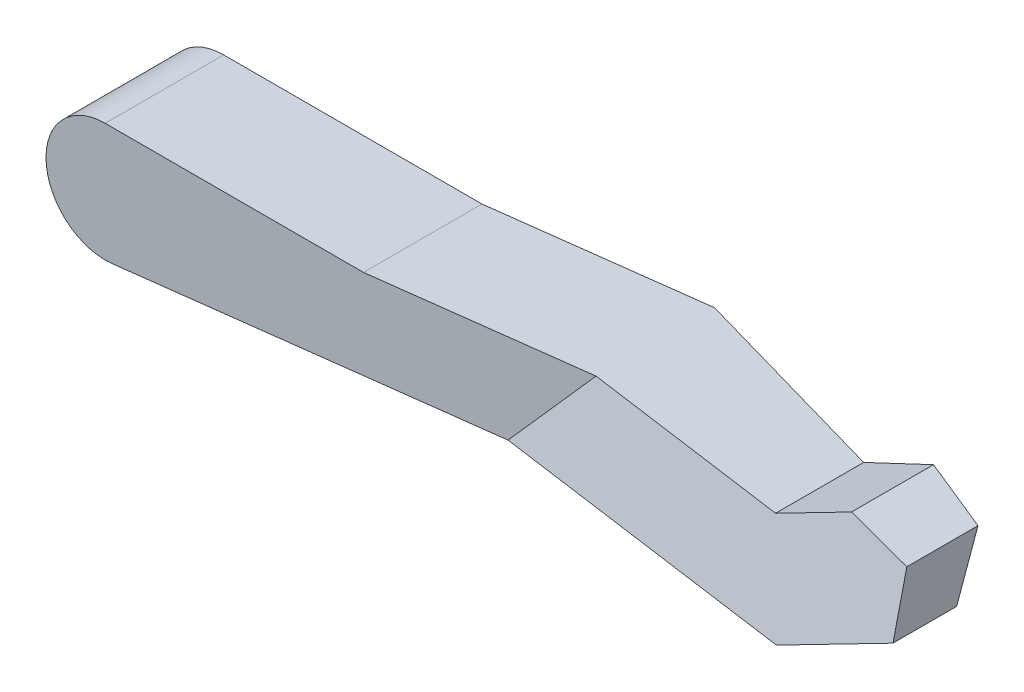
ISO-10303-21;
HEADER;
FILE_DESCRIPTION(('STEP AP214'),'2;1');
FILE_NAME('part.step','',(''),(''),'','','');
FILE_SCHEMA(('AUTOMOTIVE_DESIGN { 1 0 10303 214 1 1 1 1 }'));
ENDSEC;
DATA;
#1=APPLICATION_CONTEXT('core data for automotive mechanical design processes');
#2=APPLICATION_PROTOCOL_DEFINITION('international standard','automotive_design',2000,#1);
#3=PRODUCT_CONTEXT('',#1,'mechanical');
#4=PRODUCT('Part','Part','',(#3));
#5=PRODUCT_RELATED_PRODUCT_CATEGORY('part','',(#4));
#6=PRODUCT_DEFINITION_FORMATION('','',#4);
#7=PRODUCT_DEFINITION_CONTEXT('part definition',#1,'design');
#8=PRODUCT_DEFINITION('design','',#6,#7);
#9=PRODUCT_DEFINITION_SHAPE('','',#8);
#10=(LENGTH_UNIT() NAMED_UNIT(*) SI_UNIT(.MILLI.,.METRE.));
#11=(NAMED_UNIT(*) PLANE_ANGLE_UNIT() SI_UNIT($,.RADIAN.));
#12=(NAMED_UNIT(*) SI_UNIT($,.STERADIAN.) SOLID_ANGLE_UNIT());
#13=UNCERTAINTY_MEASURE_WITH_UNIT(LENGTH_MEASURE(1.E-05),#10,'distance_accuracy_value','');
#14=(GEOMETRIC_REPRESENTATION_CONTEXT(3) GLOBAL_UNCERTAINTY_ASSIGNED_CONTEXT((#13)) GLOBAL_UNIT_ASSIGNED_CONTEXT((#10,
#11,#12)) REPRESENTATION_CONTEXT('',''));
#15=CARTESIAN_POINT('',(0.,0.,0.));
#16=DIRECTION('',(0.,0.,1.));
#17=DIRECTION('',(1.,0.,0.));
#18=AXIS2_PLACEMENT_3D('',#15,#16,#17);
#19=CARTESIAN_POINT('',(0.,0.,11.));
#20=DIRECTION('',(0.,0.,1.));
#21=DIRECTION('',(-1.,0.,0.));
#22=AXIS2_PLACEMENT_3D('',#19,#20,#21);
#23=PLANE('',#22);
#24=DIRECTION('',(-0.993571855676588,-0.1132032137679,0.));
#25=VECTOR('',#24,1.);
#26=CARTESIAN_POINT('',(49.0397786357323,7.60031647523773,11.));
#27=LINE('',#26,#25);
#28=CARTESIAN_POINT('',(33.1426806960217,5.78907095124608,11.));
#29=VERTEX_POINT('',#28);
#30=CARTESIAN_POINT('',(17.4402064834858,4.,11.));
#31=VERTEX_POINT('',#30);
#32=EDGE_CURVE('E169',#29,#31,#27,.T.);
#33=ORIENTED_EDGE('',*,*,#32,.T.);
#34=DIRECTION('',(-1.,0.,0.));
#35=VECTOR('',#34,1.);
#36=CARTESIAN_POINT('',(17.4402064834858,4.,11.));
#37=LINE('',#36,#35);
#38=CARTESIAN_POINT('',(0.,4.,11.));
#39=VERTEX_POINT('',#38);
#40=EDGE_CURVE('E172',#31,#39,#37,.T.);
#41=ORIENTED_EDGE('',*,*,#40,.T.);
#42=CARTESIAN_POINT('',(0.,0.,11.));
#43=DIRECTION('',(0.,0.,1.));
#44=DIRECTION('',(-1.,0.,0.));
#45=AXIS2_PLACEMENT_3D('',#42,#43,#44);
#46=CIRCLE('',#45,4.);
#47=CARTESIAN_POINT('',(0.452812855071593,-3.97428742270635,11.));
#48=VERTEX_POINT('',#47);
#49=EDGE_CURVE('E162',#39,#48,#46,.T.);
#50=ORIENTED_EDGE('',*,*,#49,.T.);
#51=DIRECTION('',(0.993571855676588,0.1132032137679,0.));
#52=VECTOR('',#51,1.);
#53=CARTESIAN_POINT('',(0.452812855071593,-3.97428742270635,11.));
#54=LINE('',#53,#52);
#55=CARTESIAN_POINT('',(27.2010599548502,-0.926709618390534,11.));
#56=VERTEX_POINT('',#55);
#57=EDGE_CURVE('E165',#48,#56,#54,.T.);
#58=ORIENTED_EDGE('',*,*,#57,.T.);
#59=DIRECTION('',(-0.662620048215741,-0.748955720788999,0.));
#60=VECTOR('',#59,1.);
#61=CARTESIAN_POINT('',(15.7179186684471,-13.9060397522108,11.));
#62=LINE('',#61,#60);
#63=EDGE_CURVE('E160',#29,#56,#62,.T.);
#64=ORIENTED_EDGE('',*,*,#63,.F.);
#65=EDGE_LOOP('',(#33,#41,#50,#58,#64));
#66=FACE_BOUND('',#65,.T.);
#67=ADVANCED_FACE('F39',(#66),#23,.T.);
#68=CARTESIAN_POINT('',(0.,0.,11.));
#69=DIRECTION('',(0.,0.,-1.));
#70=DIRECTION('',(1.,0.,0.));
#71=AXIS2_PLACEMENT_3D('',#68,#69,#70);
#72=CYLINDRICAL_SURFACE('',#71,4.);
#73=CARTESIAN_POINT('',(0.,0.,3.));
#74=DIRECTION('',(0.,0.,1.));
#75=DIRECTION('',(-1.,0.,0.));
#76=AXIS2_PLACEMENT_3D('',#73,#74,#75);
#77=CIRCLE('',#76,4.);
#78=CARTESIAN_POINT('',(0.,4.,3.));
#79=VERTEX_POINT('',#78);
#80=CARTESIAN_POINT('',(0.452812855071593,-3.97428742270635,3.));
#81=VERTEX_POINT('',#80);
#82=EDGE_CURVE('E127',#79,#81,#77,.T.);
#83=ORIENTED_EDGE('',*,*,#82,.T.);
#84=DIRECTION('',(0.,0.,-1.));
#85=VECTOR('',#84,1.);
#86=CARTESIAN_POINT('',(0.452812855071593,-3.97428742270635,11.));
#87=LINE('',#86,#85);
#88=EDGE_CURVE('E125',#48,#81,#87,.T.);
#89=ORIENTED_EDGE('',*,*,#88,.F.);
#90=ORIENTED_EDGE('',*,*,#49,.F.);
#91=DIRECTION('',(0.,0.,-1.));
#92=VECTOR('',#91,1.);
#93=CARTESIAN_POINT('',(0.,4.,11.));
#94=LINE('',#93,#92);
#95=EDGE_CURVE('E47',#39,#79,#94,.T.);
#96=ORIENTED_EDGE('',*,*,#95,.T.);
#97=EDGE_LOOP('',(#83,#89,#90,#96));
#98=FACE_BOUND('',#97,.T.);
#99=ADVANCED_FACE('F41',(#98),#72,.T.);
#100=CARTESIAN_POINT('',(17.4402064834858,4.,11.));
#101=DIRECTION('',(0.,1.,0.));
#102=DIRECTION('',(-1.,0.,0.));
#103=AXIS2_PLACEMENT_3D('',#100,#101,#102);
#104=PLANE('',#103);
#105=DIRECTION('',(-1.,0.,0.));
#106=VECTOR('',#105,1.);
#107=CARTESIAN_POINT('',(17.4402064834858,4.,3.));
#108=LINE('',#107,#106);
#109=CARTESIAN_POINT('',(17.4402064834858,4.,3.));
#110=VERTEX_POINT('',#109);
#111=EDGE_CURVE('E166',#110,#79,#108,.T.);
#112=ORIENTED_EDGE('',*,*,#111,.T.);
#113=ORIENTED_EDGE('',*,*,#95,.F.);
#114=ORIENTED_EDGE('',*,*,#40,.F.);
#115=DIRECTION('',(0.,0.,-1.));
#116=VECTOR('',#115,1.);
#117=CARTESIAN_POINT('',(17.4402064834858,4.,11.));
#118=LINE('',#117,#116);
#119=EDGE_CURVE('E180',#31,#110,#118,.T.);
#120=ORIENTED_EDGE('',*,*,#119,.T.);
#121=EDGE_LOOP('',(#112,#113,#114,#120));
#122=FACE_BOUND('',#121,.T.);
#123=ADVANCED_FACE('F209',(#122),#104,.T.);
#124=CARTESIAN_POINT('',(49.0397786357323,7.60031647523773,11.));
#125=DIRECTION('',(-0.1132032137679,0.993571855676588,0.));
#126=DIRECTION('',(-0.993571855676588,-0.1132032137679,0.));
#127=AXIS2_PLACEMENT_3D('',#124,#125,#126);
#128=PLANE('',#127);
#129=DIRECTION('',(-0.933652140999854,-0.106376224626946,-0.342020143325663));
#130=VECTOR('',#129,1.);
#131=CARTESIAN_POINT('',(49.7347941477424,7.67950349037768,9.07810636492084));
#132=LINE('',#131,#130);
#133=CARTESIAN_POINT('',(49.0397786357323,7.60031647523773,8.82350479053072));
#134=VERTEX_POINT('',#133);
#135=CARTESIAN_POINT('',(33.1426806960217,5.78907095124608,3.));
#136=VERTEX_POINT('',#135);
#137=EDGE_CURVE('E158',#134,#136,#132,.T.);
#138=ORIENTED_EDGE('',*,*,#137,.T.);
#139=DIRECTION('',(-0.993571855676588,-0.1132032137679,0.));
#140=VECTOR('',#139,1.);
#141=CARTESIAN_POINT('',(49.0397786357323,7.60031647523773,3.));
#142=LINE('',#141,#140);
#143=EDGE_CURVE('E120',#136,#110,#142,.T.);
#144=ORIENTED_EDGE('',*,*,#143,.T.);
#145=ORIENTED_EDGE('',*,*,#119,.F.);
#146=ORIENTED_EDGE('',*,*,#32,.F.);
#147=DIRECTION('',(0.967067511266677,0.110183425164921,0.229434176772775));
#148=VECTOR('',#147,1.);
#149=CARTESIAN_POINT('',(48.202954740911,7.50497243573992,14.5730096784409));
#150=LINE('',#149,#148);
#151=CARTESIAN_POINT('',(49.0397786357323,7.60031647523773,14.7715439060675));
#152=VERTEX_POINT('',#151);
#153=EDGE_CURVE('E148',#29,#152,#150,.T.);
#154=ORIENTED_EDGE('',*,*,#153,.T.);
#155=DIRECTION('',(0.,0.,-1.));
#156=VECTOR('',#155,1.);
#157=CARTESIAN_POINT('',(49.0397786357323,7.60031647523773,11.));
#158=LINE('',#157,#156);
#159=EDGE_CURVE('E183',#152,#134,#158,.T.);
#160=ORIENTED_EDGE('',*,*,#159,.T.);
#161=EDGE_LOOP('',(#138,#144,#145,#146,#154,#160));
#162=FACE_BOUND('',#161,.T.);
#163=ADVANCED_FACE('F211',(#162),#128,.T.);
#164=CARTESIAN_POINT('',(54.9282032302755,11.,11.));
#165=DIRECTION('',(-0.499999999999995,0.866025403784441,0.));
#166=DIRECTION('',(-0.866025403784441,-0.499999999999995,0.));
#167=AXIS2_PLACEMENT_3D('',#164,#165,#166);
#168=PLANE('',#167);
#169=DIRECTION('',(-0.853407406135946,-0.492714995661003,-0.17008154574525));
#170=VECTOR('',#169,1.);
#171=CARTESIAN_POINT('',(55.0737802389022,11.0840489251185,10.0260632782092));
#172=LINE('',#171,#170);
#173=CARTESIAN_POINT('',(54.9282032302755,11.,9.99705021542795));
#174=VERTEX_POINT('',#173);
#175=EDGE_CURVE('E156',#174,#134,#172,.T.);
#176=ORIENTED_EDGE('',*,*,#175,.T.);
#177=ORIENTED_EDGE('',*,*,#159,.F.);
#178=DIRECTION('',(0.860665139374154,0.496905249899788,0.111088660483856));
#179=VECTOR('',#178,1.);
#180=CARTESIAN_POINT('',(54.4949381736029,10.7498543028996,15.4756578965893));
#181=LINE('',#180,#179);
#182=CARTESIAN_POINT('',(54.9282032302755,11.,15.5315807318226));
#183=VERTEX_POINT('',#182);
#184=EDGE_CURVE('E145',#152,#183,#181,.T.);
#185=ORIENTED_EDGE('',*,*,#184,.T.);
#186=DIRECTION('',(0.,0.,-1.));
#187=VECTOR('',#186,1.);
#188=CARTESIAN_POINT('',(54.9282032302755,11.,11.));
#189=LINE('',#188,#187);
#190=EDGE_CURVE('E186',#183,#174,#189,.T.);
#191=ORIENTED_EDGE('',*,*,#190,.T.);
#192=EDGE_LOOP('',(#176,#177,#185,#191));
#193=FACE_BOUND('',#192,.T.);
#194=ADVANCED_FACE('F216',(#193),#168,.T.);
#195=CARTESIAN_POINT('',(60.,11.,11.));
#196=DIRECTION('',(0.,1.,0.));
#197=DIRECTION('',(-1.,0.,0.));
#198=AXIS2_PLACEMENT_3D('',#195,#196,#197);
#199=PLANE('',#198);
#200=DIRECTION('',(-0.926097764547837,0.,-0.377283620767586));
#201=VECTOR('',#200,1.);
#202=CARTESIAN_POINT('',(59.6284977618995,11.,11.9119065161891));
#203=LINE('',#202,#201);
#204=CARTESIAN_POINT('',(60.,11.,12.0632530747052));
#205=VERTEX_POINT('',#204);
#206=EDGE_CURVE('E154',#205,#174,#203,.T.);
#207=ORIENTED_EDGE('',*,*,#206,.T.);
#208=ORIENTED_EDGE('',*,*,#190,.F.);
#209=DIRECTION('',(0.966911264947976,0.,0.255112927380611));
#210=VECTOR('',#209,1.);
#211=CARTESIAN_POINT('',(58.5521021471396,11.,16.4877216877999));
#212=LINE('',#211,#210);
#213=CARTESIAN_POINT('',(60.,11.,16.8697396383419));
#214=VERTEX_POINT('',#213);
#215=EDGE_CURVE('E142',#183,#214,#212,.T.);
#216=ORIENTED_EDGE('',*,*,#215,.T.);
#217=DIRECTION('',(0.,0.,-1.));
#218=VECTOR('',#217,1.);
#219=CARTESIAN_POINT('',(60.,11.,11.));
#220=LINE('',#219,#218);
#221=EDGE_CURVE('E189',#214,#205,#220,.T.);
#222=ORIENTED_EDGE('',*,*,#221,.T.);
#223=EDGE_LOOP('',(#207,#208,#216,#222));
#224=FACE_BOUND('',#223,.T.);
#225=ADVANCED_FACE('F219',(#224),#199,.T.);
#226=CARTESIAN_POINT('',(60.,7.00000000000001,11.));
#227=DIRECTION('',(1.,0.,0.));
#228=DIRECTION('',(0.,0.,1.));
#229=AXIS2_PLACEMENT_3D('',#226,#227,#228);
#230=PLANE('',#229);
#231=DIRECTION('',(0.,0.940758767954674,-0.339076599777106));
#232=VECTOR('',#231,1.);
#233=CARTESIAN_POINT('',(60.,7.79905809934093,13.2169648791875));
#234=LINE('',#233,#232);
#235=CARTESIAN_POINT('',(60.,7.00000000000001,13.5049684700953));
#236=VERTEX_POINT('',#235);
#237=EDGE_CURVE('E152',#236,#205,#234,.T.);
#238=ORIENTED_EDGE('',*,*,#237,.T.);
#239=ORIENTED_EDGE('',*,*,#221,.F.);
#240=DIRECTION('',(0.,-0.973820652158255,0.227317701532615));
#241=VECTOR('',#240,1.);
#242=CARTESIAN_POINT('',(60.,8.50605808104209,17.4518972907976));
#243=LINE('',#242,#241);
#244=CARTESIAN_POINT('',(60.,7.00000000000001,17.8034544903685));
#245=VERTEX_POINT('',#244);
#246=EDGE_CURVE('E139',#214,#245,#243,.T.);
#247=ORIENTED_EDGE('',*,*,#246,.T.);
#248=DIRECTION('',(0.,0.,-1.));
#249=VECTOR('',#248,1.);
#250=CARTESIAN_POINT('',(60.,7.00000000000001,11.));
#251=LINE('',#250,#249);
#252=EDGE_CURVE('E192',#245,#236,#251,.T.);
#253=ORIENTED_EDGE('',*,*,#252,.T.);
#254=EDGE_LOOP('',(#238,#239,#247,#253));
#255=FACE_BOUND('',#254,.T.);
#256=ADVANCED_FACE('F221',(#255),#230,.T.);
#257=CARTESIAN_POINT('',(50.9589773774762,1.78016315513645,11.));
#258=DIRECTION('',(0.499999999999994,-0.866025403784442,0.));
#259=DIRECTION('',(0.866025403784442,0.499999999999994,0.));
#260=AXIS2_PLACEMENT_3D('',#257,#258,#259);
#261=PLANE('',#260);
#262=DIRECTION('',(0.853407406135947,0.492714995661002,0.170081545745251));
#263=VECTOR('',#262,1.);
#264=CARTESIAN_POINT('',(50.856920364053,1.72124051096392,11.6827800215618));
#265=LINE('',#264,#263);
#266=CARTESIAN_POINT('',(50.9589773774762,1.78016315513645,11.7031196793529));
#267=VERTEX_POINT('',#266);
#268=EDGE_CURVE('E132',#267,#236,#265,.T.);
#269=ORIENTED_EDGE('',*,*,#268,.T.);
#270=ORIENTED_EDGE('',*,*,#252,.F.);
#271=DIRECTION('',(-0.860665139374154,-0.496905249899787,-0.111088660483856));
#272=VECTOR('',#271,1.);
#273=CARTESIAN_POINT('',(50.4200706203417,1.46902519383677,16.5669439433164));
#274=LINE('',#273,#272);
#275=CARTESIAN_POINT('',(50.9589773774761,1.78016315513645,16.6365022733068));
#276=VERTEX_POINT('',#275);
#277=EDGE_CURVE('E134',#245,#276,#274,.T.);
#278=ORIENTED_EDGE('',*,*,#277,.T.);
#279=DIRECTION('',(0.,0.,-1.));
#280=VECTOR('',#279,1.);
#281=CARTESIAN_POINT('',(50.9589773774762,1.78016315513645,11.));
#282=LINE('',#281,#280);
#283=EDGE_CURVE('E195',#276,#267,#282,.T.);
#284=ORIENTED_EDGE('',*,*,#283,.T.);
#285=EDGE_LOOP('',(#269,#270,#278,#284));
#286=FACE_BOUND('',#285,.T.);
#287=ADVANCED_FACE('F197',(#286),#261,.T.);
#288=CARTESIAN_POINT('',(0.452812855071593,-3.97428742270635,11.));
#289=DIRECTION('',(0.1132032137679,-0.993571855676588,0.));
#290=DIRECTION('',(0.993571855676588,0.1132032137679,0.));
#291=AXIS2_PLACEMENT_3D('',#288,#289,#290);
#292=PLANE('',#291);
#293=DIRECTION('',(0.933652140999854,0.106376224626946,0.342020143325663));
#294=VECTOR('',#293,1.);
#295=CARTESIAN_POINT('',(27.2010599548502,-0.926709618390531,3.));
#296=LINE('',#295,#294);
#297=CARTESIAN_POINT('',(27.2010599548502,-0.926709618390531,3.));
#298=VERTEX_POINT('',#297);
#299=EDGE_CURVE('E123',#298,#267,#296,.T.);
#300=ORIENTED_EDGE('',*,*,#299,.T.);
#301=ORIENTED_EDGE('',*,*,#283,.F.);
#302=DIRECTION('',(-0.967067511266677,-0.110183425164921,-0.229434176772776));
#303=VECTOR('',#302,1.);
#304=CARTESIAN_POINT('',(60.9211455975199,2.9152088512904,19.));
#305=LINE('',#304,#303);
#306=EDGE_CURVE('E60',#276,#56,#305,.T.);
#307=ORIENTED_EDGE('',*,*,#306,.T.);
#308=ORIENTED_EDGE('',*,*,#57,.F.);
#309=ORIENTED_EDGE('',*,*,#88,.T.);
#310=DIRECTION('',(0.993571855676588,0.1132032137679,0.));
#311=VECTOR('',#310,1.);
#312=CARTESIAN_POINT('',(0.452812855071593,-3.97428742270635,3.));
#313=LINE('',#312,#311);
#314=EDGE_CURVE('E117',#81,#298,#313,.T.);
#315=ORIENTED_EDGE('',*,*,#314,.T.);
#316=EDGE_LOOP('',(#300,#301,#307,#308,#309,#315));
#317=FACE_BOUND('',#316,.T.);
#318=ADVANCED_FACE('F122',(#317),#292,.T.);
#319=CARTESIAN_POINT('',(0.,0.,3.));
#320=DIRECTION('',(0.,0.,1.));
#321=DIRECTION('',(-1.,0.,0.));
#322=AXIS2_PLACEMENT_3D('',#319,#320,#321);
#323=PLANE('',#322);
#324=ORIENTED_EDGE('',*,*,#314,.F.);
#325=ORIENTED_EDGE('',*,*,#82,.F.);
#326=ORIENTED_EDGE('',*,*,#111,.F.);
#327=ORIENTED_EDGE('',*,*,#143,.F.);
#328=DIRECTION('',(0.662620048215742,0.748955720788998,0.));
#329=VECTOR('',#328,1.);
#330=CARTESIAN_POINT('',(15.717918668447,-13.9060397522108,3.));
#331=LINE('',#330,#329);
#332=EDGE_CURVE('E11',#298,#136,#331,.T.);
#333=ORIENTED_EDGE('',*,*,#332,.F.);
#334=EDGE_LOOP('',(#324,#325,#326,#327,#333));
#335=FACE_BOUND('',#334,.T.);
#336=ADVANCED_FACE('F115',(#335),#323,.F.);
#337=CARTESIAN_POINT('',(81.24092784299,25.8825446554381,19.));
#338=DIRECTION('',(0.248853040522902,-0.220166572112178,-0.943185477383362));
#339=DIRECTION('',(0.966911264947976,0.,0.255112927380611));
#340=AXIS2_PLACEMENT_3D('',#337,#338,#339);
#341=PLANE('',#340);
#342=ORIENTED_EDGE('',*,*,#153,.F.);
#343=ORIENTED_EDGE('',*,*,#63,.T.);
#344=ORIENTED_EDGE('',*,*,#306,.F.);
#345=ORIENTED_EDGE('',*,*,#277,.F.);
#346=ORIENTED_EDGE('',*,*,#246,.F.);
#347=ORIENTED_EDGE('',*,*,#215,.F.);
#348=ORIENTED_EDGE('',*,*,#184,.F.);
#349=EDGE_LOOP('',(#342,#343,#344,#345,#346,#347,#348));
#350=FACE_BOUND('',#349,.T.);
#351=ADVANCED_FACE('F200',(#350),#341,.F.);
#352=CARTESIAN_POINT('',(47.5208422003202,22.0406261857572,3.));
#353=DIRECTION('',(-0.357873358037031,0.31661960136684,0.878452439029912));
#354=DIRECTION('',(-0.926097764547837,0.,-0.377283620767586));
#355=AXIS2_PLACEMENT_3D('',#352,#353,#354);
#356=PLANE('',#355);
#357=ORIENTED_EDGE('',*,*,#137,.F.);
#358=ORIENTED_EDGE('',*,*,#175,.F.);
#359=ORIENTED_EDGE('',*,*,#206,.F.);
#360=ORIENTED_EDGE('',*,*,#237,.F.);
#361=ORIENTED_EDGE('',*,*,#268,.F.);
#362=ORIENTED_EDGE('',*,*,#299,.F.);
#363=ORIENTED_EDGE('',*,*,#332,.T.);
#364=EDGE_LOOP('',(#357,#358,#359,#360,#361,#362,#363));
#365=FACE_BOUND('',#364,.T.);
#366=ADVANCED_FACE('F130',(#365),#356,.F.);
#367=CLOSED_SHELL('',(#67,#99,#123,#163,#194,#225,#256,#287,#318,#336,#351,#366));
#368=MANIFOLD_SOLID_BREP('B2',#367);
#369=ADVANCED_BREP_SHAPE_REPRESENTATION('',(#18,#368),#14);
#370=SHAPE_DEFINITION_REPRESENTATION(#9,#369);
ENDSEC;
END-ISO-10303-21;
